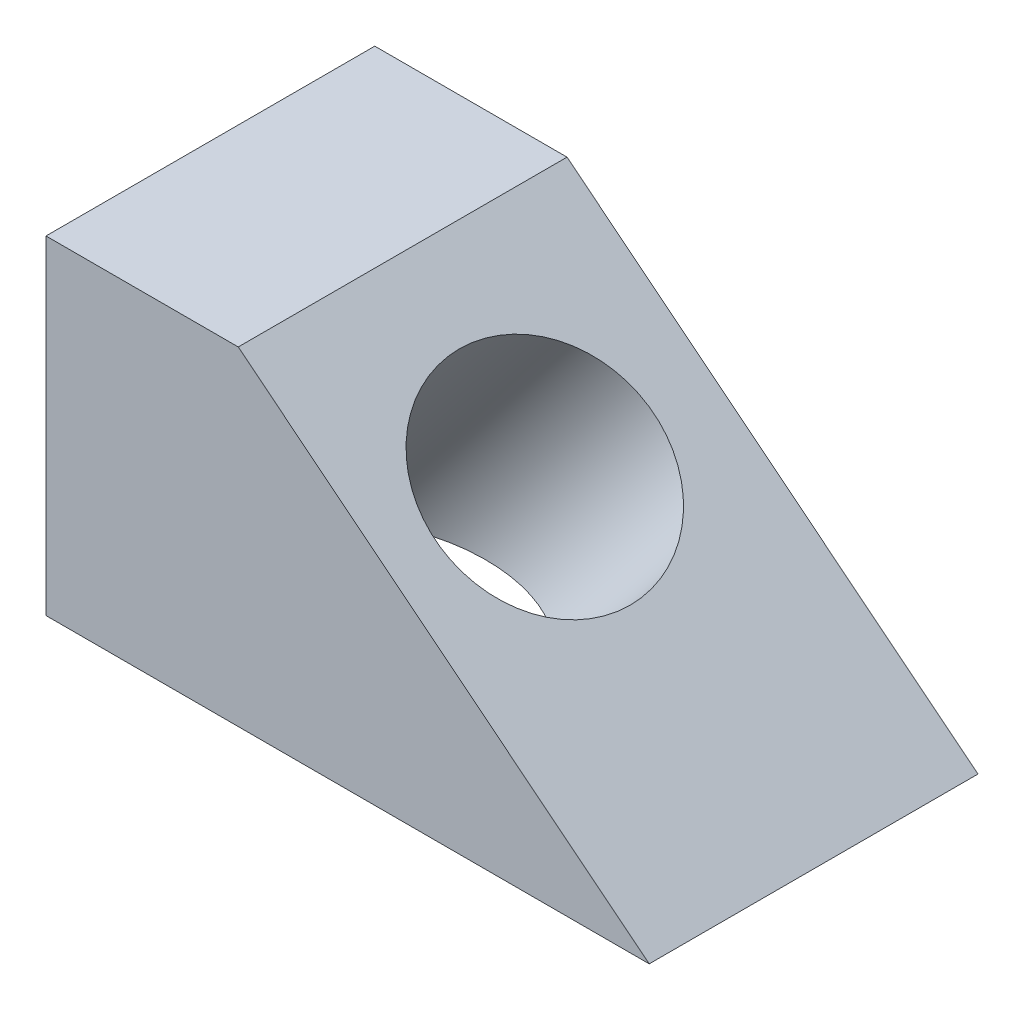
ISO-10303-21;
HEADER;
FILE_DESCRIPTION(('STEP AP214'),'2;1');
FILE_NAME('part.step','',(''),(''),'','','');
FILE_SCHEMA(('AUTOMOTIVE_DESIGN { 1 0 10303 214 1 1 1 1 }'));
ENDSEC;
DATA;
#1=APPLICATION_CONTEXT('core data for automotive mechanical design processes');
#2=APPLICATION_PROTOCOL_DEFINITION('international standard','automotive_design',2000,#1);
#3=PRODUCT_CONTEXT('',#1,'mechanical');
#4=PRODUCT('Part','Part','',(#3));
#5=PRODUCT_RELATED_PRODUCT_CATEGORY('part','',(#4));
#6=PRODUCT_DEFINITION_FORMATION('','',#4);
#7=PRODUCT_DEFINITION_CONTEXT('part definition',#1,'design');
#8=PRODUCT_DEFINITION('design','',#6,#7);
#9=PRODUCT_DEFINITION_SHAPE('','',#8);
#10=(LENGTH_UNIT() NAMED_UNIT(*) SI_UNIT(.MILLI.,.METRE.));
#11=(NAMED_UNIT(*) PLANE_ANGLE_UNIT() SI_UNIT($,.RADIAN.));
#12=(NAMED_UNIT(*) SI_UNIT($,.STERADIAN.) SOLID_ANGLE_UNIT());
#13=UNCERTAINTY_MEASURE_WITH_UNIT(LENGTH_MEASURE(1.E-05),#10,'distance_accuracy_value','');
#14=(GEOMETRIC_REPRESENTATION_CONTEXT(3) GLOBAL_UNCERTAINTY_ASSIGNED_CONTEXT((#13)) GLOBAL_UNIT_ASSIGNED_CONTEXT((#10,
#11,#12)) REPRESENTATION_CONTEXT('',''));
#15=CARTESIAN_POINT('',(0.,0.,0.));
#16=DIRECTION('',(0.,0.,1.));
#17=DIRECTION('',(1.,0.,0.));
#18=AXIS2_PLACEMENT_3D('',#15,#16,#17);
#19=CARTESIAN_POINT('',(0.,59.944,29.972));
#20=DIRECTION('',(0.,1.,0.));
#21=DIRECTION('',(0.,0.,1.));
#22=AXIS2_PLACEMENT_3D('',#19,#20,#21);
#23=PLANE('',#22);
#24=DIRECTION('',(1.,0.,0.));
#25=VECTOR('',#24,1.);
#26=CARTESIAN_POINT('',(0.,59.944,-29.972));
#27=LINE('',#26,#25);
#28=CARTESIAN_POINT('',(0.,59.944,-29.972));
#29=VERTEX_POINT('',#28);
#30=CARTESIAN_POINT('',(35.052,59.944,-29.972));
#31=VERTEX_POINT('',#30);
#32=EDGE_CURVE('E112',#29,#31,#27,.T.);
#33=ORIENTED_EDGE('',*,*,#32,.F.);
#34=DIRECTION('',(0.,0.,-1.));
#35=VECTOR('',#34,1.);
#36=CARTESIAN_POINT('',(0.,59.944,29.972));
#37=LINE('',#36,#35);
#38=CARTESIAN_POINT('',(0.,59.944,29.972));
#39=VERTEX_POINT('',#38);
#40=EDGE_CURVE('E11',#39,#29,#37,.T.);
#41=ORIENTED_EDGE('',*,*,#40,.F.);
#42=DIRECTION('',(1.,0.,0.));
#43=VECTOR('',#42,1.);
#44=CARTESIAN_POINT('',(0.,59.944,29.972));
#45=LINE('',#44,#43);
#46=CARTESIAN_POINT('',(35.052,59.944,29.972));
#47=VERTEX_POINT('',#46);
#48=EDGE_CURVE('E102',#39,#47,#45,.T.);
#49=ORIENTED_EDGE('',*,*,#48,.T.);
#50=DIRECTION('',(0.,0.,-1.));
#51=VECTOR('',#50,1.);
#52=CARTESIAN_POINT('',(35.052,59.944,29.972));
#53=LINE('',#52,#51);
#54=EDGE_CURVE('E43',#47,#31,#53,.T.);
#55=ORIENTED_EDGE('',*,*,#54,.T.);
#56=EDGE_LOOP('',(#33,#41,#49,#55));
#57=FACE_BOUND('',#56,.T.);
#58=ADVANCED_FACE('F40',(#57),#23,.T.);
#59=CARTESIAN_POINT('',(0.,0.,29.972));
#60=DIRECTION('',(-1.,0.,0.));
#61=DIRECTION('',(0.,0.,1.));
#62=AXIS2_PLACEMENT_3D('',#59,#60,#61);
#63=PLANE('',#62);
#64=DIRECTION('',(0.,1.,0.));
#65=VECTOR('',#64,1.);
#66=CARTESIAN_POINT('',(0.,0.,-29.972));
#67=LINE('',#66,#65);
#68=CARTESIAN_POINT('',(0.,0.,-29.972));
#69=VERTEX_POINT('',#68);
#70=EDGE_CURVE('E106',#69,#29,#67,.T.);
#71=ORIENTED_EDGE('',*,*,#70,.F.);
#72=DIRECTION('',(0.,0.,-1.));
#73=VECTOR('',#72,1.);
#74=CARTESIAN_POINT('',(0.,0.,29.972));
#75=LINE('',#74,#73);
#76=CARTESIAN_POINT('',(0.,0.,29.972));
#77=VERTEX_POINT('',#76);
#78=EDGE_CURVE('E50',#77,#69,#75,.T.);
#79=ORIENTED_EDGE('',*,*,#78,.F.);
#80=DIRECTION('',(0.,1.,0.));
#81=VECTOR('',#80,1.);
#82=CARTESIAN_POINT('',(0.,0.,29.972));
#83=LINE('',#82,#81);
#84=EDGE_CURVE('E97',#77,#39,#83,.T.);
#85=ORIENTED_EDGE('',*,*,#84,.T.);
#86=ORIENTED_EDGE('',*,*,#40,.T.);
#87=EDGE_LOOP('',(#71,#79,#85,#86));
#88=FACE_BOUND('',#87,.T.);
#89=ADVANCED_FACE('F135',(#88),#63,.T.);
#90=CARTESIAN_POINT('',(109.982,0.,29.972));
#91=DIRECTION('',(0.,-1.,0.));
#92=DIRECTION('',(1.,0.,0.));
#93=AXIS2_PLACEMENT_3D('',#90,#91,#92);
#94=PLANE('',#93);
#95=CARTESIAN_POINT('',(31.2645518746955,0.,1.016));
#96=DIRECTION('',(0.,-1.,0.));
#97=DIRECTION('',(1.,0.,0.));
#98=AXIS2_PLACEMENT_3D('',#95,#96,#97);
#99=ELLIPSE('',#98,25.5343788340347,19.939);
#100=CARTESIAN_POINT('',(56.7989307087302,0.,1.016));
#101=VERTEX_POINT('',#100);
#102=EDGE_CURVE('E117',#101,#101,#99,.F.);
#103=ORIENTED_EDGE('',*,*,#102,.T.);
#104=EDGE_LOOP('',(#103));
#105=FACE_BOUND('',#104,.T.);
#106=DIRECTION('',(-1.,0.,0.));
#107=VECTOR('',#106,1.);
#108=CARTESIAN_POINT('',(109.982,0.,-29.972));
#109=LINE('',#108,#107);
#110=CARTESIAN_POINT('',(109.982,0.,-29.972));
#111=VERTEX_POINT('',#110);
#112=EDGE_CURVE('E91',#111,#69,#109,.T.);
#113=ORIENTED_EDGE('',*,*,#112,.F.);
#114=DIRECTION('',(0.,0.,-1.));
#115=VECTOR('',#114,1.);
#116=CARTESIAN_POINT('',(109.982,0.,29.972));
#117=LINE('',#116,#115);
#118=CARTESIAN_POINT('',(109.982,0.,29.972));
#119=VERTEX_POINT('',#118);
#120=EDGE_CURVE('E86',#119,#111,#117,.T.);
#121=ORIENTED_EDGE('',*,*,#120,.F.);
#122=DIRECTION('',(-1.,0.,0.));
#123=VECTOR('',#122,1.);
#124=CARTESIAN_POINT('',(109.982,0.,29.972));
#125=LINE('',#124,#123);
#126=EDGE_CURVE('E89',#119,#77,#125,.T.);
#127=ORIENTED_EDGE('',*,*,#126,.T.);
#128=ORIENTED_EDGE('',*,*,#78,.T.);
#129=EDGE_LOOP('',(#113,#121,#127,#128));
#130=FACE_BOUND('',#129,.T.);
#131=ADVANCED_FACE('F88',(#105,#130),#94,.T.);
#132=CARTESIAN_POINT('',(35.052,59.944,29.972));
#133=DIRECTION('',(0.624695047554424,0.78086880944303,0.));
#134=DIRECTION('',(-0.78086880944303,0.624695047554424,0.));
#135=AXIS2_PLACEMENT_3D('',#132,#133,#134);
#136=PLANE('',#135);
#137=CARTESIAN_POINT('',(61.9835560211558,38.3987551830754,1.016));
#138=DIRECTION('',(0.624695047554424,0.78086880944303,0.));
#139=DIRECTION('',(-0.78086880944303,0.624695047554424,0.));
#140=AXIS2_PLACEMENT_3D('',#137,#138,#139);
#141=CIRCLE('',#140,19.939);
#142=CARTESIAN_POINT('',(46.4138128296712,50.854549736263,1.016));
#143=VERTEX_POINT('',#142);
#144=EDGE_CURVE('E153',#143,#143,#141,.T.);
#145=ORIENTED_EDGE('',*,*,#144,.F.);
#146=EDGE_LOOP('',(#145));
#147=FACE_BOUND('',#146,.T.);
#148=DIRECTION('',(0.78086880944303,-0.624695047554424,0.));
#149=VECTOR('',#148,1.);
#150=CARTESIAN_POINT('',(35.052,59.944,-29.972));
#151=LINE('',#150,#149);
#152=EDGE_CURVE('E116',#31,#111,#151,.T.);
#153=ORIENTED_EDGE('',*,*,#152,.F.);
#154=ORIENTED_EDGE('',*,*,#54,.F.);
#155=DIRECTION('',(0.78086880944303,-0.624695047554424,0.));
#156=VECTOR('',#155,1.);
#157=CARTESIAN_POINT('',(35.052,59.944,29.972));
#158=LINE('',#157,#156);
#159=EDGE_CURVE('E96',#47,#119,#158,.T.);
#160=ORIENTED_EDGE('',*,*,#159,.T.);
#161=ORIENTED_EDGE('',*,*,#120,.T.);
#162=EDGE_LOOP('',(#153,#154,#160,#161));
#163=FACE_BOUND('',#162,.T.);
#164=ADVANCED_FACE('F100',(#147,#163),#136,.T.);
#165=CARTESIAN_POINT('',(0.,0.,29.972));
#166=DIRECTION('',(0.,0.,1.));
#167=DIRECTION('',(1.,0.,0.));
#168=AXIS2_PLACEMENT_3D('',#165,#166,#167);
#169=PLANE('',#168);
#170=ORIENTED_EDGE('',*,*,#48,.F.);
#171=ORIENTED_EDGE('',*,*,#84,.F.);
#172=ORIENTED_EDGE('',*,*,#126,.F.);
#173=ORIENTED_EDGE('',*,*,#159,.F.);
#174=EDGE_LOOP('',(#170,#171,#172,#173));
#175=FACE_BOUND('',#174,.T.);
#176=ADVANCED_FACE('F95',(#175),#169,.T.);
#177=CARTESIAN_POINT('',(0.,0.,-29.972));
#178=DIRECTION('',(0.,0.,1.));
#179=DIRECTION('',(1.,0.,0.));
#180=AXIS2_PLACEMENT_3D('',#177,#178,#179);
#181=PLANE('',#180);
#182=ORIENTED_EDGE('',*,*,#32,.T.);
#183=ORIENTED_EDGE('',*,*,#152,.T.);
#184=ORIENTED_EDGE('',*,*,#112,.T.);
#185=ORIENTED_EDGE('',*,*,#70,.T.);
#186=EDGE_LOOP('',(#182,#183,#184,#185));
#187=FACE_BOUND('',#186,.T.);
#188=ADVANCED_FACE('F134',(#187),#181,.F.);
#189=CARTESIAN_POINT('',(-8.90900508868116,-50.2169462042208,1.016));
#190=DIRECTION('',(0.624695047554424,0.78086880944303,0.));
#191=DIRECTION('',(-0.78086880944303,0.624695047554424,0.));
#192=AXIS2_PLACEMENT_3D('',#189,#190,#191);
#193=CYLINDRICAL_SURFACE('',#192,19.939);
#194=ORIENTED_EDGE('',*,*,#144,.T.);
#195=EDGE_LOOP('',(#194));
#196=FACE_BOUND('',#195,.T.);
#197=ORIENTED_EDGE('',*,*,#102,.F.);
#198=EDGE_LOOP('',(#197));
#199=FACE_BOUND('',#198,.T.);
#200=ADVANCED_FACE('F163',(#196,#199),#193,.F.);
#201=CLOSED_SHELL('',(#58,#89,#131,#164,#176,#188,#200));
#202=MANIFOLD_SOLID_BREP('B2',#201);
#203=ADVANCED_BREP_SHAPE_REPRESENTATION('',(#18,#202),#14);
#204=SHAPE_DEFINITION_REPRESENTATION(#9,#203);
ENDSEC;
END-ISO-10303-21;
